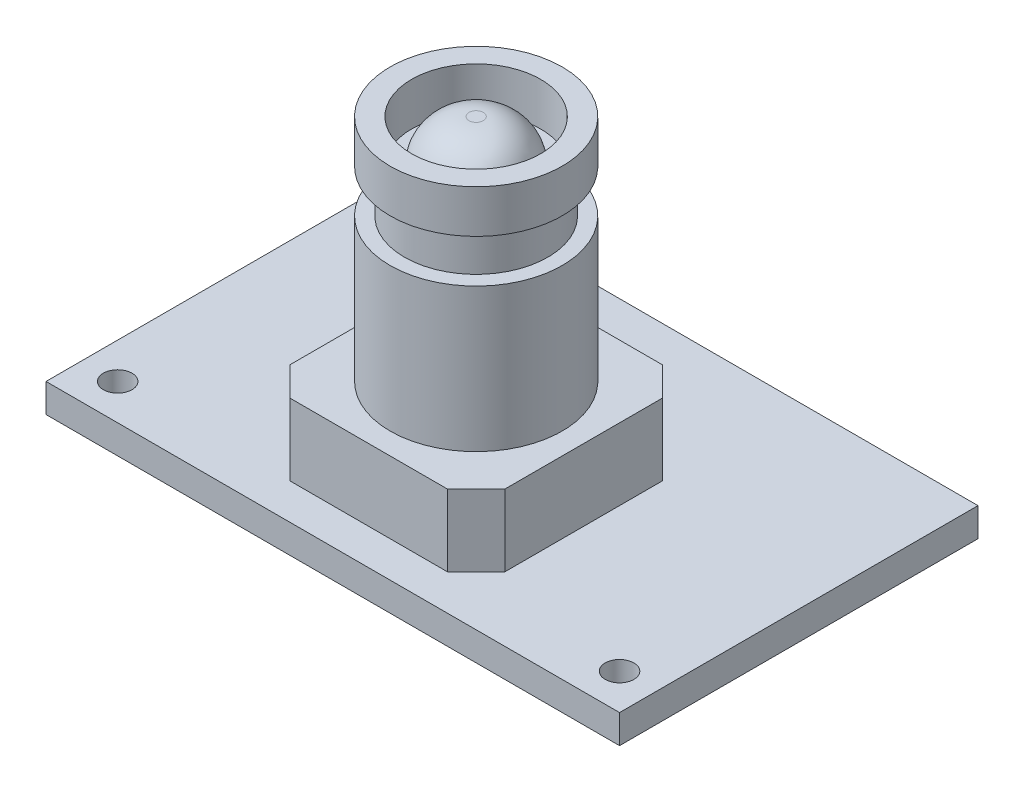
ISO-10303-21;
HEADER;
FILE_DESCRIPTION(('STEP AP214'),'2;1');
FILE_NAME('part.step','',(''),(''),'','','');
FILE_SCHEMA(('AUTOMOTIVE_DESIGN { 1 0 10303 214 1 1 1 1 }'));
ENDSEC;
DATA;
#1=APPLICATION_CONTEXT('core data for automotive mechanical design processes');
#2=APPLICATION_PROTOCOL_DEFINITION('international standard','automotive_design',2000,#1);
#3=PRODUCT_CONTEXT('',#1,'mechanical');
#4=PRODUCT('Part','Part','',(#3));
#5=PRODUCT_RELATED_PRODUCT_CATEGORY('part','',(#4));
#6=PRODUCT_DEFINITION_FORMATION('','',#4);
#7=PRODUCT_DEFINITION_CONTEXT('part definition',#1,'design');
#8=PRODUCT_DEFINITION('design','',#6,#7);
#9=PRODUCT_DEFINITION_SHAPE('','',#8);
#10=(LENGTH_UNIT() NAMED_UNIT(*) SI_UNIT(.MILLI.,.METRE.));
#11=(NAMED_UNIT(*) PLANE_ANGLE_UNIT() SI_UNIT($,.RADIAN.));
#12=(NAMED_UNIT(*) SI_UNIT($,.STERADIAN.) SOLID_ANGLE_UNIT());
#13=UNCERTAINTY_MEASURE_WITH_UNIT(LENGTH_MEASURE(1.E-05),#10,'distance_accuracy_value','');
#14=(GEOMETRIC_REPRESENTATION_CONTEXT(3) GLOBAL_UNCERTAINTY_ASSIGNED_CONTEXT((#13)) GLOBAL_UNIT_ASSIGNED_CONTEXT((#10,
#11,#12)) REPRESENTATION_CONTEXT('',''));
#15=CARTESIAN_POINT('',(0.,0.,0.));
#16=DIRECTION('',(0.,0.,1.));
#17=DIRECTION('',(1.,0.,0.));
#18=AXIS2_PLACEMENT_3D('',#15,#16,#17);
#19=CARTESIAN_POINT('',(20.,20.,-10.));
#20=DIRECTION('',(0.,1.,0.));
#21=DIRECTION('',(0.,0.,1.));
#22=AXIS2_PLACEMENT_3D('',#19,#20,#21);
#23=PLANE('',#22);
#24=CARTESIAN_POINT('',(20.,20.,-10.));
#25=DIRECTION('',(0.,1.,0.));
#26=DIRECTION('',(0.,0.,1.));
#27=AXIS2_PLACEMENT_3D('',#24,#25,#26);
#28=CIRCLE('',#27,4.5);
#29=CARTESIAN_POINT('',(20.,20.,-5.5));
#30=VERTEX_POINT('',#29);
#31=EDGE_CURVE('E40',#30,#30,#28,.F.);
#32=ORIENTED_EDGE('',*,*,#31,.F.);
#33=EDGE_LOOP('',(#32));
#34=FACE_BOUND('',#33,.T.);
#35=CARTESIAN_POINT('',(20.,20.,-10.));
#36=DIRECTION('',(0.,1.,0.));
#37=DIRECTION('',(0.,0.,1.));
#38=AXIS2_PLACEMENT_3D('',#35,#36,#37);
#39=CIRCLE('',#38,3.5);
#40=CARTESIAN_POINT('',(20.,20.,-6.50000000000001));
#41=VERTEX_POINT('',#40);
#42=EDGE_CURVE('E203',#41,#41,#39,.T.);
#43=ORIENTED_EDGE('',*,*,#42,.F.);
#44=EDGE_LOOP('',(#43));
#45=FACE_BOUND('',#44,.T.);
#46=ADVANCED_FACE('F32',(#34,#45),#23,.T.);
#47=CARTESIAN_POINT('',(20.,17.,-10.));
#48=DIRECTION('',(0.,1.,0.));
#49=DIRECTION('',(0.,0.,1.));
#50=AXIS2_PLACEMENT_3D('',#47,#48,#49);
#51=PLANE('',#50);
#52=CARTESIAN_POINT('',(20.,17.,-10.));
#53=DIRECTION('',(0.,1.,0.));
#54=DIRECTION('',(0.,0.,1.));
#55=AXIS2_PLACEMENT_3D('',#52,#53,#54);
#56=CIRCLE('',#55,6.);
#57=CARTESIAN_POINT('',(20.,17.,-4.));
#58=VERTEX_POINT('',#57);
#59=EDGE_CURVE('E220',#58,#58,#56,.T.);
#60=ORIENTED_EDGE('',*,*,#59,.T.);
#61=EDGE_LOOP('',(#60));
#62=FACE_BOUND('',#61,.T.);
#63=CARTESIAN_POINT('',(20.,17.,-10.));
#64=DIRECTION('',(0.,1.,0.));
#65=DIRECTION('',(0.,0.,1.));
#66=AXIS2_PLACEMENT_3D('',#63,#64,#65);
#67=CIRCLE('',#66,5.);
#68=CARTESIAN_POINT('',(20.,17.,-5.));
#69=VERTEX_POINT('',#68);
#70=EDGE_CURVE('E214',#69,#69,#67,.T.);
#71=ORIENTED_EDGE('',*,*,#70,.F.);
#72=EDGE_LOOP('',(#71));
#73=FACE_BOUND('',#72,.T.);
#74=ADVANCED_FACE('F199',(#62,#73),#51,.T.);
#75=CARTESIAN_POINT('',(20.,7.,-23.));
#76=DIRECTION('',(0.,-1.,0.));
#77=DIRECTION('',(0.,0.,-1.));
#78=AXIS2_PLACEMENT_3D('',#75,#76,#77);
#79=PLANE('',#78);
#80=DIRECTION('',(-0.707106781186546,0.,0.707106781186549));
#81=VECTOR('',#80,1.);
#82=CARTESIAN_POINT('',(12.5,7.,-15.5));
#83=LINE('',#82,#81);
#84=CARTESIAN_POINT('',(14.5,7.,-17.5));
#85=VERTEX_POINT('',#84);
#86=CARTESIAN_POINT('',(12.5,7.,-15.5));
#87=VERTEX_POINT('',#86);
#88=EDGE_CURVE('E129',#85,#87,#83,.T.);
#89=ORIENTED_EDGE('',*,*,#88,.T.);
#90=DIRECTION('',(0.,0.,1.));
#91=VECTOR('',#90,1.);
#92=CARTESIAN_POINT('',(12.5,7.,-4.5));
#93=LINE('',#92,#91);
#94=CARTESIAN_POINT('',(12.5,7.,-4.5));
#95=VERTEX_POINT('',#94);
#96=EDGE_CURVE('E118',#87,#95,#93,.T.);
#97=ORIENTED_EDGE('',*,*,#96,.T.);
#98=DIRECTION('',(0.707106781186547,0.,0.707106781186548));
#99=VECTOR('',#98,1.);
#100=CARTESIAN_POINT('',(14.5,7.,-2.5));
#101=LINE('',#100,#99);
#102=CARTESIAN_POINT('',(14.5,7.,-2.5));
#103=VERTEX_POINT('',#102);
#104=EDGE_CURVE('E128',#95,#103,#101,.T.);
#105=ORIENTED_EDGE('',*,*,#104,.T.);
#106=DIRECTION('',(1.,0.,0.));
#107=VECTOR('',#106,1.);
#108=CARTESIAN_POINT('',(25.5,7.,-2.5));
#109=LINE('',#108,#107);
#110=CARTESIAN_POINT('',(25.5,7.,-2.5));
#111=VERTEX_POINT('',#110);
#112=EDGE_CURVE('E226',#103,#111,#109,.T.);
#113=ORIENTED_EDGE('',*,*,#112,.T.);
#114=DIRECTION('',(0.707106781186549,0.,-0.707106781186547));
#115=VECTOR('',#114,1.);
#116=CARTESIAN_POINT('',(27.5,7.,-4.5));
#117=LINE('',#116,#115);
#118=CARTESIAN_POINT('',(27.5,7.,-4.5));
#119=VERTEX_POINT('',#118);
#120=EDGE_CURVE('E228',#111,#119,#117,.T.);
#121=ORIENTED_EDGE('',*,*,#120,.T.);
#122=DIRECTION('',(0.,0.,-1.));
#123=VECTOR('',#122,1.);
#124=CARTESIAN_POINT('',(27.5,7.,-15.5));
#125=LINE('',#124,#123);
#126=CARTESIAN_POINT('',(27.5,7.,-15.5));
#127=VERTEX_POINT('',#126);
#128=EDGE_CURVE('E230',#119,#127,#125,.T.);
#129=ORIENTED_EDGE('',*,*,#128,.T.);
#130=DIRECTION('',(-0.707106781186547,0.,-0.707106781186549));
#131=VECTOR('',#130,1.);
#132=CARTESIAN_POINT('',(25.5,7.,-17.5));
#133=LINE('',#132,#131);
#134=CARTESIAN_POINT('',(25.5,7.,-17.5));
#135=VERTEX_POINT('',#134);
#136=EDGE_CURVE('E232',#127,#135,#133,.T.);
#137=ORIENTED_EDGE('',*,*,#136,.T.);
#138=DIRECTION('',(-1.,0.,0.));
#139=VECTOR('',#138,1.);
#140=CARTESIAN_POINT('',(14.5,7.,-17.5));
#141=LINE('',#140,#139);
#142=EDGE_CURVE('E135',#135,#85,#141,.T.);
#143=ORIENTED_EDGE('',*,*,#142,.T.);
#144=EDGE_LOOP('',(#89,#97,#105,#113,#121,#129,#137,#143));
#145=FACE_BOUND('',#144,.T.);
#146=CARTESIAN_POINT('',(20.,7.,-10.));
#147=DIRECTION('',(0.,-1.,0.));
#148=DIRECTION('',(0.,0.,-1.));
#149=AXIS2_PLACEMENT_3D('',#146,#147,#148);
#150=CIRCLE('',#149,6.);
#151=CARTESIAN_POINT('',(20.,7.,-16.));
#152=VERTEX_POINT('',#151);
#153=EDGE_CURVE('E190',#152,#152,#150,.F.);
#154=ORIENTED_EDGE('',*,*,#153,.F.);
#155=EDGE_LOOP('',(#154));
#156=FACE_BOUND('',#155,.T.);
#157=ADVANCED_FACE('F132',(#145,#156),#79,.F.);
#158=CARTESIAN_POINT('',(0.,2.,-25.));
#159=DIRECTION('',(0.,-1.,0.));
#160=DIRECTION('',(0.,0.,-1.));
#161=AXIS2_PLACEMENT_3D('',#158,#159,#160);
#162=PLANE('',#161);
#163=CARTESIAN_POINT('',(37.5,2.,-2.5));
#164=DIRECTION('',(0.,1.,0.));
#165=DIRECTION('',(0.,0.,-1.));
#166=AXIS2_PLACEMENT_3D('',#163,#164,#165);
#167=CIRCLE('',#166,0.999999999999998);
#168=CARTESIAN_POINT('',(37.5,2.,-3.5));
#169=VERTEX_POINT('',#168);
#170=EDGE_CURVE('E146',#169,#169,#167,.T.);
#171=ORIENTED_EDGE('',*,*,#170,.F.);
#172=EDGE_LOOP('',(#171));
#173=FACE_BOUND('',#172,.T.);
#174=DIRECTION('',(0.,0.,1.));
#175=VECTOR('',#174,1.);
#176=CARTESIAN_POINT('',(0.,2.,0.));
#177=LINE('',#176,#175);
#178=CARTESIAN_POINT('',(0.,2.,-25.));
#179=VERTEX_POINT('',#178);
#180=CARTESIAN_POINT('',(0.,2.,0.));
#181=VERTEX_POINT('',#180);
#182=EDGE_CURVE('E161',#179,#181,#177,.T.);
#183=ORIENTED_EDGE('',*,*,#182,.T.);
#184=DIRECTION('',(1.,0.,0.));
#185=VECTOR('',#184,1.);
#186=CARTESIAN_POINT('',(0.,2.,0.));
#187=LINE('',#186,#185);
#188=CARTESIAN_POINT('',(40.,2.,0.));
#189=VERTEX_POINT('',#188);
#190=EDGE_CURVE('E164',#181,#189,#187,.T.);
#191=ORIENTED_EDGE('',*,*,#190,.T.);
#192=DIRECTION('',(0.,0.,-1.));
#193=VECTOR('',#192,1.);
#194=CARTESIAN_POINT('',(40.,2.,0.));
#195=LINE('',#194,#193);
#196=CARTESIAN_POINT('',(40.,2.,-25.));
#197=VERTEX_POINT('',#196);
#198=EDGE_CURVE('E167',#189,#197,#195,.T.);
#199=ORIENTED_EDGE('',*,*,#198,.T.);
#200=DIRECTION('',(-1.,0.,0.));
#201=VECTOR('',#200,1.);
#202=CARTESIAN_POINT('',(0.,2.,-25.));
#203=LINE('',#202,#201);
#204=EDGE_CURVE('E169',#197,#179,#203,.T.);
#205=ORIENTED_EDGE('',*,*,#204,.T.);
#206=EDGE_LOOP('',(#183,#191,#199,#205));
#207=FACE_BOUND('',#206,.T.);
#208=CARTESIAN_POINT('',(2.5,2.,-2.5));
#209=DIRECTION('',(0.,1.,0.));
#210=DIRECTION('',(0.,0.,1.));
#211=AXIS2_PLACEMENT_3D('',#208,#209,#210);
#212=CIRCLE('',#211,1.);
#213=CARTESIAN_POINT('',(2.5,2.,-1.5));
#214=VERTEX_POINT('',#213);
#215=EDGE_CURVE('E155',#214,#214,#212,.T.);
#216=ORIENTED_EDGE('',*,*,#215,.F.);
#217=EDGE_LOOP('',(#216));
#218=FACE_BOUND('',#217,.T.);
#219=DIRECTION('',(-0.707106781186546,0.,0.707106781186549));
#220=VECTOR('',#219,1.);
#221=CARTESIAN_POINT('',(12.5,2.,-15.5));
#222=LINE('',#221,#220);
#223=CARTESIAN_POINT('',(14.5,2.,-17.5));
#224=VERTEX_POINT('',#223);
#225=CARTESIAN_POINT('',(12.5,2.,-15.5));
#226=VERTEX_POINT('',#225);
#227=EDGE_CURVE('E142',#224,#226,#222,.T.);
#228=ORIENTED_EDGE('',*,*,#227,.F.);
#229=DIRECTION('',(-1.,0.,0.));
#230=VECTOR('',#229,1.);
#231=CARTESIAN_POINT('',(14.5,2.,-17.5));
#232=LINE('',#231,#230);
#233=CARTESIAN_POINT('',(25.5,2.,-17.5));
#234=VERTEX_POINT('',#233);
#235=EDGE_CURVE('E139',#234,#224,#232,.T.);
#236=ORIENTED_EDGE('',*,*,#235,.F.);
#237=DIRECTION('',(-0.707106781186547,0.,-0.707106781186549));
#238=VECTOR('',#237,1.);
#239=CARTESIAN_POINT('',(25.5,2.,-17.5));
#240=LINE('',#239,#238);
#241=CARTESIAN_POINT('',(27.5,2.,-15.5));
#242=VERTEX_POINT('',#241);
#243=EDGE_CURVE('E248',#242,#234,#240,.T.);
#244=ORIENTED_EDGE('',*,*,#243,.F.);
#245=DIRECTION('',(0.,0.,-1.));
#246=VECTOR('',#245,1.);
#247=CARTESIAN_POINT('',(27.5,2.,-15.5));
#248=LINE('',#247,#246);
#249=CARTESIAN_POINT('',(27.5,2.,-4.5));
#250=VERTEX_POINT('',#249);
#251=EDGE_CURVE('E245',#250,#242,#248,.T.);
#252=ORIENTED_EDGE('',*,*,#251,.F.);
#253=DIRECTION('',(0.707106781186549,0.,-0.707106781186547));
#254=VECTOR('',#253,1.);
#255=CARTESIAN_POINT('',(27.5,2.,-4.5));
#256=LINE('',#255,#254);
#257=CARTESIAN_POINT('',(25.5,2.,-2.5));
#258=VERTEX_POINT('',#257);
#259=EDGE_CURVE('E242',#258,#250,#256,.T.);
#260=ORIENTED_EDGE('',*,*,#259,.F.);
#261=DIRECTION('',(1.,0.,0.));
#262=VECTOR('',#261,1.);
#263=CARTESIAN_POINT('',(25.5,2.,-2.5));
#264=LINE('',#263,#262);
#265=CARTESIAN_POINT('',(14.5,2.,-2.50000000000001));
#266=VERTEX_POINT('',#265);
#267=EDGE_CURVE('E239',#266,#258,#264,.T.);
#268=ORIENTED_EDGE('',*,*,#267,.F.);
#269=DIRECTION('',(0.707106781186547,0.,0.707106781186548));
#270=VECTOR('',#269,1.);
#271=CARTESIAN_POINT('',(14.5,2.,-2.5));
#272=LINE('',#271,#270);
#273=CARTESIAN_POINT('',(12.5,2.,-4.5));
#274=VERTEX_POINT('',#273);
#275=EDGE_CURVE('E52',#274,#266,#272,.T.);
#276=ORIENTED_EDGE('',*,*,#275,.F.);
#277=DIRECTION('',(0.,0.,1.));
#278=VECTOR('',#277,1.);
#279=CARTESIAN_POINT('',(12.5,2.,-4.5));
#280=LINE('',#279,#278);
#281=EDGE_CURVE('E47',#226,#274,#280,.T.);
#282=ORIENTED_EDGE('',*,*,#281,.F.);
#283=EDGE_LOOP('',(#228,#236,#244,#252,#260,#268,#276,#282));
#284=FACE_BOUND('',#283,.T.);
#285=ADVANCED_FACE('F287',(#173,#207,#218,#284),#162,.F.);
#286=CARTESIAN_POINT('',(0.,0.,-25.));
#287=DIRECTION('',(0.,-1.,0.));
#288=DIRECTION('',(0.,0.,-1.));
#289=AXIS2_PLACEMENT_3D('',#286,#287,#288);
#290=PLANE('',#289);
#291=CARTESIAN_POINT('',(2.5,0.,-2.5));
#292=DIRECTION('',(0.,1.,0.));
#293=DIRECTION('',(0.,0.,1.));
#294=AXIS2_PLACEMENT_3D('',#291,#292,#293);
#295=CIRCLE('',#294,1.);
#296=CARTESIAN_POINT('',(2.5,0.,-1.5));
#297=VERTEX_POINT('',#296);
#298=EDGE_CURVE('E153',#297,#297,#295,.T.);
#299=ORIENTED_EDGE('',*,*,#298,.T.);
#300=EDGE_LOOP('',(#299));
#301=FACE_BOUND('',#300,.T.);
#302=DIRECTION('',(0.,0.,1.));
#303=VECTOR('',#302,1.);
#304=CARTESIAN_POINT('',(0.,0.,0.));
#305=LINE('',#304,#303);
#306=CARTESIAN_POINT('',(0.,0.,-25.));
#307=VERTEX_POINT('',#306);
#308=CARTESIAN_POINT('',(0.,0.,0.));
#309=VERTEX_POINT('',#308);
#310=EDGE_CURVE('E158',#307,#309,#305,.T.);
#311=ORIENTED_EDGE('',*,*,#310,.F.);
#312=DIRECTION('',(-1.,0.,0.));
#313=VECTOR('',#312,1.);
#314=CARTESIAN_POINT('',(0.,0.,-25.));
#315=LINE('',#314,#313);
#316=CARTESIAN_POINT('',(40.,0.,-25.));
#317=VERTEX_POINT('',#316);
#318=EDGE_CURVE('E165',#317,#307,#315,.T.);
#319=ORIENTED_EDGE('',*,*,#318,.F.);
#320=DIRECTION('',(0.,0.,-1.));
#321=VECTOR('',#320,1.);
#322=CARTESIAN_POINT('',(40.,0.,0.));
#323=LINE('',#322,#321);
#324=CARTESIAN_POINT('',(40.,0.,0.));
#325=VERTEX_POINT('',#324);
#326=EDGE_CURVE('E176',#325,#317,#323,.T.);
#327=ORIENTED_EDGE('',*,*,#326,.F.);
#328=DIRECTION('',(1.,0.,0.));
#329=VECTOR('',#328,1.);
#330=CARTESIAN_POINT('',(0.,0.,0.));
#331=LINE('',#330,#329);
#332=EDGE_CURVE('E174',#309,#325,#331,.T.);
#333=ORIENTED_EDGE('',*,*,#332,.F.);
#334=EDGE_LOOP('',(#311,#319,#327,#333));
#335=FACE_BOUND('',#334,.T.);
#336=CARTESIAN_POINT('',(37.5,0.,-2.5));
#337=DIRECTION('',(0.,1.,0.));
#338=DIRECTION('',(0.,0.,-1.));
#339=AXIS2_PLACEMENT_3D('',#336,#337,#338);
#340=CIRCLE('',#339,0.999999999999998);
#341=CARTESIAN_POINT('',(37.5,0.,-3.5));
#342=VERTEX_POINT('',#341);
#343=EDGE_CURVE('E143',#342,#342,#340,.T.);
#344=ORIENTED_EDGE('',*,*,#343,.T.);
#345=EDGE_LOOP('',(#344));
#346=FACE_BOUND('',#345,.T.);
#347=ADVANCED_FACE('F289',(#301,#335,#346),#290,.T.);
#348=CARTESIAN_POINT('',(0.,2.,0.));
#349=DIRECTION('',(1.,0.,0.));
#350=DIRECTION('',(0.,0.,-1.));
#351=AXIS2_PLACEMENT_3D('',#348,#349,#350);
#352=PLANE('',#351);
#353=ORIENTED_EDGE('',*,*,#310,.T.);
#354=DIRECTION('',(0.,-1.,0.));
#355=VECTOR('',#354,1.);
#356=CARTESIAN_POINT('',(0.,2.,0.));
#357=LINE('',#356,#355);
#358=EDGE_CURVE('E187',#181,#309,#357,.T.);
#359=ORIENTED_EDGE('',*,*,#358,.F.);
#360=ORIENTED_EDGE('',*,*,#182,.F.);
#361=DIRECTION('',(0.,-1.,0.));
#362=VECTOR('',#361,1.);
#363=CARTESIAN_POINT('',(0.,2.,-25.));
#364=LINE('',#363,#362);
#365=EDGE_CURVE('E171',#179,#307,#364,.T.);
#366=ORIENTED_EDGE('',*,*,#365,.T.);
#367=EDGE_LOOP('',(#353,#359,#360,#366));
#368=FACE_BOUND('',#367,.T.);
#369=ADVANCED_FACE('F296',(#368),#352,.F.);
#370=CARTESIAN_POINT('',(0.,2.,0.));
#371=DIRECTION('',(0.,0.,-1.));
#372=DIRECTION('',(-1.,0.,0.));
#373=AXIS2_PLACEMENT_3D('',#370,#371,#372);
#374=PLANE('',#373);
#375=ORIENTED_EDGE('',*,*,#332,.T.);
#376=DIRECTION('',(0.,-1.,0.));
#377=VECTOR('',#376,1.);
#378=CARTESIAN_POINT('',(40.,2.,0.));
#379=LINE('',#378,#377);
#380=EDGE_CURVE('E184',#189,#325,#379,.T.);
#381=ORIENTED_EDGE('',*,*,#380,.F.);
#382=ORIENTED_EDGE('',*,*,#190,.F.);
#383=ORIENTED_EDGE('',*,*,#358,.T.);
#384=EDGE_LOOP('',(#375,#381,#382,#383));
#385=FACE_BOUND('',#384,.T.);
#386=ADVANCED_FACE('F313',(#385),#374,.F.);
#387=CARTESIAN_POINT('',(40.,2.,0.));
#388=DIRECTION('',(-1.,0.,0.));
#389=DIRECTION('',(0.,0.,1.));
#390=AXIS2_PLACEMENT_3D('',#387,#388,#389);
#391=PLANE('',#390);
#392=ORIENTED_EDGE('',*,*,#326,.T.);
#393=DIRECTION('',(0.,-1.,0.));
#394=VECTOR('',#393,1.);
#395=CARTESIAN_POINT('',(40.,2.,-25.));
#396=LINE('',#395,#394);
#397=EDGE_CURVE('E181',#197,#317,#396,.T.);
#398=ORIENTED_EDGE('',*,*,#397,.F.);
#399=ORIENTED_EDGE('',*,*,#198,.F.);
#400=ORIENTED_EDGE('',*,*,#380,.T.);
#401=EDGE_LOOP('',(#392,#398,#399,#400));
#402=FACE_BOUND('',#401,.T.);
#403=ADVANCED_FACE('F309',(#402),#391,.F.);
#404=CARTESIAN_POINT('',(0.,2.,-25.));
#405=DIRECTION('',(0.,0.,1.));
#406=DIRECTION('',(1.,0.,0.));
#407=AXIS2_PLACEMENT_3D('',#404,#405,#406);
#408=PLANE('',#407);
#409=ORIENTED_EDGE('',*,*,#318,.T.);
#410=ORIENTED_EDGE('',*,*,#365,.F.);
#411=ORIENTED_EDGE('',*,*,#204,.F.);
#412=ORIENTED_EDGE('',*,*,#397,.T.);
#413=EDGE_LOOP('',(#409,#410,#411,#412));
#414=FACE_BOUND('',#413,.T.);
#415=ADVANCED_FACE('F306',(#414),#408,.F.);
#416=CARTESIAN_POINT('',(2.5,2.,-2.5));
#417=DIRECTION('',(0.,-1.,0.));
#418=DIRECTION('',(0.,0.,-1.));
#419=AXIS2_PLACEMENT_3D('',#416,#417,#418);
#420=CYLINDRICAL_SURFACE('',#419,1.);
#421=ORIENTED_EDGE('',*,*,#215,.T.);
#422=EDGE_LOOP('',(#421));
#423=FACE_BOUND('',#422,.T.);
#424=ORIENTED_EDGE('',*,*,#298,.F.);
#425=EDGE_LOOP('',(#424));
#426=FACE_BOUND('',#425,.T.);
#427=ADVANCED_FACE('F303',(#423,#426),#420,.F.);
#428=CARTESIAN_POINT('',(37.5,2.,-2.5));
#429=DIRECTION('',(0.,-1.,0.));
#430=DIRECTION('',(0.,0.,-1.));
#431=AXIS2_PLACEMENT_3D('',#428,#429,#430);
#432=CYLINDRICAL_SURFACE('',#431,0.999999999999998);
#433=ORIENTED_EDGE('',*,*,#170,.T.);
#434=EDGE_LOOP('',(#433));
#435=FACE_BOUND('',#434,.T.);
#436=ORIENTED_EDGE('',*,*,#343,.F.);
#437=EDGE_LOOP('',(#436));
#438=FACE_BOUND('',#437,.T.);
#439=ADVANCED_FACE('F338',(#435,#438),#432,.F.);
#440=CARTESIAN_POINT('',(12.5,7.,-15.5));
#441=DIRECTION('',(0.707106781186549,0.,0.707106781186546));
#442=DIRECTION('',(0.707106781186546,0.,-0.707106781186549));
#443=AXIS2_PLACEMENT_3D('',#440,#441,#442);
#444=PLANE('',#443);
#445=ORIENTED_EDGE('',*,*,#227,.T.);
#446=DIRECTION('',(0.,-1.,0.));
#447=VECTOR('',#446,1.);
#448=CARTESIAN_POINT('',(12.5,7.,-15.5));
#449=LINE('',#448,#447);
#450=EDGE_CURVE('E122',#87,#226,#449,.T.);
#451=ORIENTED_EDGE('',*,*,#450,.F.);
#452=ORIENTED_EDGE('',*,*,#88,.F.);
#453=DIRECTION('',(0.,-1.,0.));
#454=VECTOR('',#453,1.);
#455=CARTESIAN_POINT('',(14.5,7.,-17.5));
#456=LINE('',#455,#454);
#457=EDGE_CURVE('E235',#85,#224,#456,.T.);
#458=ORIENTED_EDGE('',*,*,#457,.T.);
#459=EDGE_LOOP('',(#445,#451,#452,#458));
#460=FACE_BOUND('',#459,.T.);
#461=ADVANCED_FACE('F141',(#460),#444,.F.);
#462=CARTESIAN_POINT('',(12.5,7.,-4.5));
#463=DIRECTION('',(1.,0.,0.));
#464=DIRECTION('',(0.,0.,-1.));
#465=AXIS2_PLACEMENT_3D('',#462,#463,#464);
#466=PLANE('',#465);
#467=ORIENTED_EDGE('',*,*,#281,.T.);
#468=DIRECTION('',(0.,-1.,0.));
#469=VECTOR('',#468,1.);
#470=CARTESIAN_POINT('',(12.5,7.,-4.5));
#471=LINE('',#470,#469);
#472=EDGE_CURVE('E125',#95,#274,#471,.T.);
#473=ORIENTED_EDGE('',*,*,#472,.F.);
#474=ORIENTED_EDGE('',*,*,#96,.F.);
#475=ORIENTED_EDGE('',*,*,#450,.T.);
#476=EDGE_LOOP('',(#467,#473,#474,#475));
#477=FACE_BOUND('',#476,.T.);
#478=ADVANCED_FACE('F120',(#477),#466,.F.);
#479=CARTESIAN_POINT('',(14.5,7.,-2.5));
#480=DIRECTION('',(0.707106781186548,0.,-0.707106781186547));
#481=DIRECTION('',(-0.707106781186547,0.,-0.707106781186548));
#482=AXIS2_PLACEMENT_3D('',#479,#480,#481);
#483=PLANE('',#482);
#484=ORIENTED_EDGE('',*,*,#275,.T.);
#485=DIRECTION('',(0.,-1.,0.));
#486=VECTOR('',#485,1.);
#487=CARTESIAN_POINT('',(14.5,7.,-2.5));
#488=LINE('',#487,#486);
#489=EDGE_CURVE('E148',#103,#266,#488,.T.);
#490=ORIENTED_EDGE('',*,*,#489,.F.);
#491=ORIENTED_EDGE('',*,*,#104,.F.);
#492=ORIENTED_EDGE('',*,*,#472,.T.);
#493=EDGE_LOOP('',(#484,#490,#491,#492));
#494=FACE_BOUND('',#493,.T.);
#495=ADVANCED_FACE('F272',(#494),#483,.F.);
#496=CARTESIAN_POINT('',(25.5,7.,-2.5));
#497=DIRECTION('',(0.,0.,-1.));
#498=DIRECTION('',(-1.,0.,0.));
#499=AXIS2_PLACEMENT_3D('',#496,#497,#498);
#500=PLANE('',#499);
#501=ORIENTED_EDGE('',*,*,#267,.T.);
#502=DIRECTION('',(0.,-1.,0.));
#503=VECTOR('',#502,1.);
#504=CARTESIAN_POINT('',(25.5,7.,-2.5));
#505=LINE('',#504,#503);
#506=EDGE_CURVE('E263',#111,#258,#505,.T.);
#507=ORIENTED_EDGE('',*,*,#506,.F.);
#508=ORIENTED_EDGE('',*,*,#112,.F.);
#509=ORIENTED_EDGE('',*,*,#489,.T.);
#510=EDGE_LOOP('',(#501,#507,#508,#509));
#511=FACE_BOUND('',#510,.T.);
#512=ADVANCED_FACE('F269',(#511),#500,.F.);
#513=CARTESIAN_POINT('',(27.5,7.,-4.5));
#514=DIRECTION('',(-0.707106781186547,0.,-0.707106781186549));
#515=DIRECTION('',(-0.707106781186549,0.,0.707106781186547));
#516=AXIS2_PLACEMENT_3D('',#513,#514,#515);
#517=PLANE('',#516);
#518=ORIENTED_EDGE('',*,*,#259,.T.);
#519=DIRECTION('',(0.,-1.,0.));
#520=VECTOR('',#519,1.);
#521=CARTESIAN_POINT('',(27.5,7.,-4.5));
#522=LINE('',#521,#520);
#523=EDGE_CURVE('E260',#119,#250,#522,.T.);
#524=ORIENTED_EDGE('',*,*,#523,.F.);
#525=ORIENTED_EDGE('',*,*,#120,.F.);
#526=ORIENTED_EDGE('',*,*,#506,.T.);
#527=EDGE_LOOP('',(#518,#524,#525,#526));
#528=FACE_BOUND('',#527,.T.);
#529=ADVANCED_FACE('F276',(#528),#517,.F.);
#530=CARTESIAN_POINT('',(27.5,7.,-15.5));
#531=DIRECTION('',(-1.,0.,0.));
#532=DIRECTION('',(0.,0.,1.));
#533=AXIS2_PLACEMENT_3D('',#530,#531,#532);
#534=PLANE('',#533);
#535=ORIENTED_EDGE('',*,*,#251,.T.);
#536=DIRECTION('',(0.,-1.,0.));
#537=VECTOR('',#536,1.);
#538=CARTESIAN_POINT('',(27.5,7.,-15.5));
#539=LINE('',#538,#537);
#540=EDGE_CURVE('E257',#127,#242,#539,.T.);
#541=ORIENTED_EDGE('',*,*,#540,.F.);
#542=ORIENTED_EDGE('',*,*,#128,.F.);
#543=ORIENTED_EDGE('',*,*,#523,.T.);
#544=EDGE_LOOP('',(#535,#541,#542,#543));
#545=FACE_BOUND('',#544,.T.);
#546=ADVANCED_FACE('F280',(#545),#534,.F.);
#547=CARTESIAN_POINT('',(25.5,7.,-17.5));
#548=DIRECTION('',(-0.707106781186548,0.,0.707106781186547));
#549=DIRECTION('',(0.707106781186547,0.,0.707106781186548));
#550=AXIS2_PLACEMENT_3D('',#547,#548,#549);
#551=PLANE('',#550);
#552=ORIENTED_EDGE('',*,*,#243,.T.);
#553=DIRECTION('',(0.,-1.,0.));
#554=VECTOR('',#553,1.);
#555=CARTESIAN_POINT('',(25.5,7.,-17.5));
#556=LINE('',#555,#554);
#557=EDGE_CURVE('E254',#135,#234,#556,.T.);
#558=ORIENTED_EDGE('',*,*,#557,.F.);
#559=ORIENTED_EDGE('',*,*,#136,.F.);
#560=ORIENTED_EDGE('',*,*,#540,.T.);
#561=EDGE_LOOP('',(#552,#558,#559,#560));
#562=FACE_BOUND('',#561,.T.);
#563=ADVANCED_FACE('F284',(#562),#551,.F.);
#564=CARTESIAN_POINT('',(14.5,7.,-17.5));
#565=DIRECTION('',(0.,0.,1.));
#566=DIRECTION('',(1.,0.,0.));
#567=AXIS2_PLACEMENT_3D('',#564,#565,#566);
#568=PLANE('',#567);
#569=ORIENTED_EDGE('',*,*,#235,.T.);
#570=ORIENTED_EDGE('',*,*,#457,.F.);
#571=ORIENTED_EDGE('',*,*,#142,.F.);
#572=ORIENTED_EDGE('',*,*,#557,.T.);
#573=EDGE_LOOP('',(#569,#570,#571,#572));
#574=FACE_BOUND('',#573,.T.);
#575=ADVANCED_FACE('F286',(#574),#568,.F.);
#576=CARTESIAN_POINT('',(20.,17.,-10.));
#577=DIRECTION('',(0.,-1.,0.));
#578=DIRECTION('',(0.,0.,-1.));
#579=AXIS2_PLACEMENT_3D('',#576,#577,#578);
#580=CYLINDRICAL_SURFACE('',#579,6.);
#581=ORIENTED_EDGE('',*,*,#59,.F.);
#582=EDGE_LOOP('',(#581));
#583=FACE_BOUND('',#582,.T.);
#584=ORIENTED_EDGE('',*,*,#153,.T.);
#585=EDGE_LOOP('',(#584));
#586=FACE_BOUND('',#585,.T.);
#587=ADVANCED_FACE('F363',(#583,#586),#580,.T.);
#588=CARTESIAN_POINT('',(20.,20.,-10.));
#589=DIRECTION('',(0.,-1.,0.));
#590=DIRECTION('',(0.,0.,-1.));
#591=AXIS2_PLACEMENT_3D('',#588,#589,#590);
#592=CYLINDRICAL_SURFACE('',#591,5.);
#593=CARTESIAN_POINT('',(20.,20.,-10.));
#594=DIRECTION('',(0.,1.,0.));
#595=DIRECTION('',(0.,0.,1.));
#596=AXIS2_PLACEMENT_3D('',#593,#594,#595);
#597=CIRCLE('',#596,5.);
#598=CARTESIAN_POINT('',(20.,20.,-5.));
#599=VERTEX_POINT('',#598);
#600=EDGE_CURVE('E217',#599,#599,#597,.T.);
#601=ORIENTED_EDGE('',*,*,#600,.F.);
#602=EDGE_LOOP('',(#601));
#603=FACE_BOUND('',#602,.T.);
#604=ORIENTED_EDGE('',*,*,#70,.T.);
#605=EDGE_LOOP('',(#604));
#606=FACE_BOUND('',#605,.T.);
#607=ADVANCED_FACE('F367',(#603,#606),#592,.T.);
#608=CARTESIAN_POINT('',(20.,20.,-10.));
#609=DIRECTION('',(0.,1.,0.));
#610=DIRECTION('',(0.,0.,1.));
#611=AXIS2_PLACEMENT_3D('',#608,#609,#610);
#612=PLANE('',#611);
#613=CARTESIAN_POINT('',(20.,20.,-10.));
#614=DIRECTION('',(0.,1.,0.));
#615=DIRECTION('',(0.,0.,1.));
#616=AXIS2_PLACEMENT_3D('',#613,#614,#615);
#617=CIRCLE('',#616,6.);
#618=CARTESIAN_POINT('',(20.,20.,-4.));
#619=VERTEX_POINT('',#618);
#620=EDGE_CURVE('E208',#619,#619,#617,.T.);
#621=ORIENTED_EDGE('',*,*,#620,.F.);
#622=EDGE_LOOP('',(#621));
#623=FACE_BOUND('',#622,.T.);
#624=ORIENTED_EDGE('',*,*,#600,.T.);
#625=EDGE_LOOP('',(#624));
#626=FACE_BOUND('',#625,.T.);
#627=ADVANCED_FACE('F373',(#623,#626),#612,.F.);
#628=CARTESIAN_POINT('',(20.,23.,-10.));
#629=DIRECTION('',(0.,1.,0.));
#630=DIRECTION('',(0.,0.,1.));
#631=AXIS2_PLACEMENT_3D('',#628,#629,#630);
#632=PLANE('',#631);
#633=CARTESIAN_POINT('',(20.,23.,-10.));
#634=DIRECTION('',(0.,1.,0.));
#635=DIRECTION('',(0.,0.,1.));
#636=AXIS2_PLACEMENT_3D('',#633,#634,#635);
#637=CIRCLE('',#636,6.);
#638=CARTESIAN_POINT('',(20.,23.,-4.));
#639=VERTEX_POINT('',#638);
#640=EDGE_CURVE('E211',#639,#639,#637,.T.);
#641=ORIENTED_EDGE('',*,*,#640,.T.);
#642=EDGE_LOOP('',(#641));
#643=FACE_BOUND('',#642,.T.);
#644=CARTESIAN_POINT('',(20.,23.,-10.));
#645=DIRECTION('',(0.,1.,0.));
#646=DIRECTION('',(0.,0.,1.));
#647=AXIS2_PLACEMENT_3D('',#644,#645,#646);
#648=CIRCLE('',#647,4.5);
#649=CARTESIAN_POINT('',(20.,23.,-5.5));
#650=VERTEX_POINT('',#649);
#651=EDGE_CURVE('E205',#650,#650,#648,.T.);
#652=ORIENTED_EDGE('',*,*,#651,.F.);
#653=EDGE_LOOP('',(#652));
#654=FACE_BOUND('',#653,.T.);
#655=ADVANCED_FACE('F379',(#643,#654),#632,.T.);
#656=CARTESIAN_POINT('',(20.,23.,-10.));
#657=DIRECTION('',(0.,-1.,0.));
#658=DIRECTION('',(0.,0.,-1.));
#659=AXIS2_PLACEMENT_3D('',#656,#657,#658);
#660=CYLINDRICAL_SURFACE('',#659,6.);
#661=ORIENTED_EDGE('',*,*,#640,.F.);
#662=EDGE_LOOP('',(#661));
#663=FACE_BOUND('',#662,.T.);
#664=ORIENTED_EDGE('',*,*,#620,.T.);
#665=EDGE_LOOP('',(#664));
#666=FACE_BOUND('',#665,.T.);
#667=ADVANCED_FACE('F376',(#663,#666),#660,.T.);
#668=CARTESIAN_POINT('',(20.,23.,-10.));
#669=DIRECTION('',(0.,-1.,0.));
#670=DIRECTION('',(0.,0.,-1.));
#671=AXIS2_PLACEMENT_3D('',#668,#669,#670);
#672=CYLINDRICAL_SURFACE('',#671,4.5);
#673=ORIENTED_EDGE('',*,*,#651,.T.);
#674=EDGE_LOOP('',(#673));
#675=FACE_BOUND('',#674,.T.);
#676=ORIENTED_EDGE('',*,*,#31,.T.);
#677=EDGE_LOOP('',(#676));
#678=FACE_BOUND('',#677,.T.);
#679=ADVANCED_FACE('F195',(#675,#678),#672,.F.);
#680=CARTESIAN_POINT('',(20.,23.,-10.));
#681=DIRECTION('',(0.,1.,0.));
#682=DIRECTION('',(0.,0.,1.));
#683=AXIS2_PLACEMENT_3D('',#680,#681,#682);
#684=PLANE('',#683);
#685=CARTESIAN_POINT('',(20.,23.,-10.));
#686=DIRECTION('',(0.,1.,0.));
#687=DIRECTION('',(0.,0.,1.));
#688=AXIS2_PLACEMENT_3D('',#685,#686,#687);
#689=CIRCLE('',#688,0.5);
#690=CARTESIAN_POINT('',(20.,23.,-9.50000000000001));
#691=VERTEX_POINT('',#690);
#692=EDGE_CURVE('E12',#691,#691,#689,.T.);
#693=ORIENTED_EDGE('',*,*,#692,.T.);
#694=EDGE_LOOP('',(#693));
#695=FACE_BOUND('',#694,.T.);
#696=ADVANCED_FACE('F389',(#695),#684,.T.);
#697=CARTESIAN_POINT('',(20.,20.,-10.));
#698=DIRECTION('',(0.,1.,0.));
#699=DIRECTION('',(0.,0.,1.));
#700=AXIS2_PLACEMENT_3D('',#697,#698,#699);
#701=DEGENERATE_TOROIDAL_SURFACE('',#700,0.5,3.,.T.);
#702=ORIENTED_EDGE('',*,*,#42,.T.);
#703=EDGE_LOOP('',(#702));
#704=FACE_BOUND('',#703,.T.);
#705=ORIENTED_EDGE('',*,*,#692,.F.);
#706=EDGE_LOOP('',(#705));
#707=FACE_BOUND('',#706,.T.);
#708=ADVANCED_FACE('F34',(#704,#707),#701,.T.);
#709=CLOSED_SHELL('',(#46,#74,#157,#285,#347,#369,#386,#403,#415,#427,#439,#461,#478,#495,#512,
#529,#546,#563,#575,#587,#607,#627,#655,#667,#679,#696,#708));
#710=MANIFOLD_SOLID_BREP('B2',#709);
#711=ADVANCED_BREP_SHAPE_REPRESENTATION('',(#18,#710),#14);
#712=SHAPE_DEFINITION_REPRESENTATION(#9,#711);
ENDSEC;
END-ISO-10303-21;
